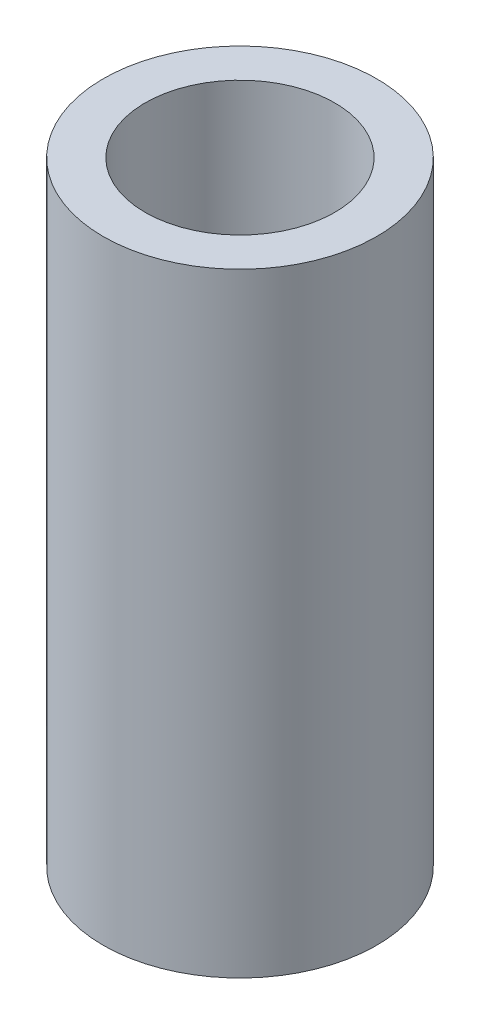
ISO-10303-21;
HEADER;
FILE_DESCRIPTION(('STEP AP214'),'2;1');
FILE_NAME('part.step','',(''),(''),'','','');
FILE_SCHEMA(('AUTOMOTIVE_DESIGN { 1 0 10303 214 1 1 1 1 }'));
ENDSEC;
DATA;
#1=APPLICATION_CONTEXT('core data for automotive mechanical design processes');
#2=APPLICATION_PROTOCOL_DEFINITION('international standard','automotive_design',2000,#1);
#3=PRODUCT_CONTEXT('',#1,'mechanical');
#4=PRODUCT('Part','Part','',(#3));
#5=PRODUCT_RELATED_PRODUCT_CATEGORY('part','',(#4));
#6=PRODUCT_DEFINITION_FORMATION('','',#4);
#7=PRODUCT_DEFINITION_CONTEXT('part definition',#1,'design');
#8=PRODUCT_DEFINITION('design','',#6,#7);
#9=PRODUCT_DEFINITION_SHAPE('','',#8);
#10=(LENGTH_UNIT() NAMED_UNIT(*) SI_UNIT(.MILLI.,.METRE.));
#11=(NAMED_UNIT(*) PLANE_ANGLE_UNIT() SI_UNIT($,.RADIAN.));
#12=(NAMED_UNIT(*) SI_UNIT($,.STERADIAN.) SOLID_ANGLE_UNIT());
#13=UNCERTAINTY_MEASURE_WITH_UNIT(LENGTH_MEASURE(1.E-05),#10,'distance_accuracy_value','');
#14=(GEOMETRIC_REPRESENTATION_CONTEXT(3) GLOBAL_UNCERTAINTY_ASSIGNED_CONTEXT((#13)) GLOBAL_UNIT_ASSIGNED_CONTEXT((#10,
#11,#12)) REPRESENTATION_CONTEXT('',''));
#15=CARTESIAN_POINT('',(0.,0.,0.));
#16=DIRECTION('',(0.,0.,1.));
#17=DIRECTION('',(1.,0.,0.));
#18=AXIS2_PLACEMENT_3D('',#15,#16,#17);
#19=CARTESIAN_POINT('',(0.,11.,0.));
#20=DIRECTION('',(0.,1.,0.));
#21=DIRECTION('',(0.,0.,1.));
#22=AXIS2_PLACEMENT_3D('',#19,#20,#21);
#23=PLANE('',#22);
#24=CARTESIAN_POINT('',(0.,11.,0.));
#25=DIRECTION('',(0.,1.,0.));
#26=DIRECTION('',(0.,0.,1.));
#27=AXIS2_PLACEMENT_3D('',#24,#25,#26);
#28=CIRCLE('',#27,2.45);
#29=CARTESIAN_POINT('',(0.,11.,2.45));
#30=VERTEX_POINT('',#29);
#31=EDGE_CURVE('E10',#30,#30,#28,.T.);
#32=ORIENTED_EDGE('',*,*,#31,.T.);
#33=EDGE_LOOP('',(#32));
#34=FACE_BOUND('',#33,.T.);
#35=CARTESIAN_POINT('',(0.,11.,0.));
#36=DIRECTION('',(0.,1.,0.));
#37=DIRECTION('',(0.,0.,1.));
#38=AXIS2_PLACEMENT_3D('',#35,#36,#37);
#39=CIRCLE('',#38,1.7);
#40=CARTESIAN_POINT('',(0.,11.,1.7));
#41=VERTEX_POINT('',#40);
#42=EDGE_CURVE('E56',#41,#41,#39,.T.);
#43=ORIENTED_EDGE('',*,*,#42,.F.);
#44=EDGE_LOOP('',(#43));
#45=FACE_BOUND('',#44,.T.);
#46=ADVANCED_FACE('F43',(#34,#45),#23,.T.);
#47=CARTESIAN_POINT('',(0.,0.,0.));
#48=DIRECTION('',(0.,1.,0.));
#49=DIRECTION('',(0.,0.,1.));
#50=AXIS2_PLACEMENT_3D('',#47,#48,#49);
#51=PLANE('',#50);
#52=CARTESIAN_POINT('',(0.,0.,0.));
#53=DIRECTION('',(0.,1.,0.));
#54=DIRECTION('',(0.,0.,1.));
#55=AXIS2_PLACEMENT_3D('',#52,#53,#54);
#56=CIRCLE('',#55,2.45);
#57=CARTESIAN_POINT('',(0.,0.,2.45));
#58=VERTEX_POINT('',#57);
#59=EDGE_CURVE('E47',#58,#58,#56,.T.);
#60=ORIENTED_EDGE('',*,*,#59,.F.);
#61=EDGE_LOOP('',(#60));
#62=FACE_BOUND('',#61,.T.);
#63=CARTESIAN_POINT('',(0.,0.,0.));
#64=DIRECTION('',(0.,1.,0.));
#65=DIRECTION('',(0.,0.,1.));
#66=AXIS2_PLACEMENT_3D('',#63,#64,#65);
#67=CIRCLE('',#66,1.7);
#68=CARTESIAN_POINT('',(0.,0.,1.7));
#69=VERTEX_POINT('',#68);
#70=EDGE_CURVE('E58',#69,#69,#67,.T.);
#71=ORIENTED_EDGE('',*,*,#70,.T.);
#72=EDGE_LOOP('',(#71));
#73=FACE_BOUND('',#72,.T.);
#74=ADVANCED_FACE('F70',(#62,#73),#51,.F.);
#75=CARTESIAN_POINT('',(0.,11.,0.));
#76=DIRECTION('',(0.,-1.,0.));
#77=DIRECTION('',(0.,0.,-1.));
#78=AXIS2_PLACEMENT_3D('',#75,#76,#77);
#79=CYLINDRICAL_SURFACE('',#78,2.45);
#80=ORIENTED_EDGE('',*,*,#31,.F.);
#81=EDGE_LOOP('',(#80));
#82=FACE_BOUND('',#81,.T.);
#83=ORIENTED_EDGE('',*,*,#59,.T.);
#84=EDGE_LOOP('',(#83));
#85=FACE_BOUND('',#84,.T.);
#86=ADVANCED_FACE('F45',(#82,#85),#79,.T.);
#87=CARTESIAN_POINT('',(0.,11.,0.));
#88=DIRECTION('',(0.,-1.,0.));
#89=DIRECTION('',(0.,0.,-1.));
#90=AXIS2_PLACEMENT_3D('',#87,#88,#89);
#91=CYLINDRICAL_SURFACE('',#90,1.7);
#92=ORIENTED_EDGE('',*,*,#42,.T.);
#93=EDGE_LOOP('',(#92));
#94=FACE_BOUND('',#93,.T.);
#95=ORIENTED_EDGE('',*,*,#70,.F.);
#96=EDGE_LOOP('',(#95));
#97=FACE_BOUND('',#96,.T.);
#98=ADVANCED_FACE('F66',(#94,#97),#91,.F.);
#99=CLOSED_SHELL('',(#46,#74,#86,#98));
#100=MANIFOLD_SOLID_BREP('B2',#99);
#101=ADVANCED_BREP_SHAPE_REPRESENTATION('',(#18,#100),#14);
#102=SHAPE_DEFINITION_REPRESENTATION(#9,#101);
ENDSEC;
END-ISO-10303-21;
